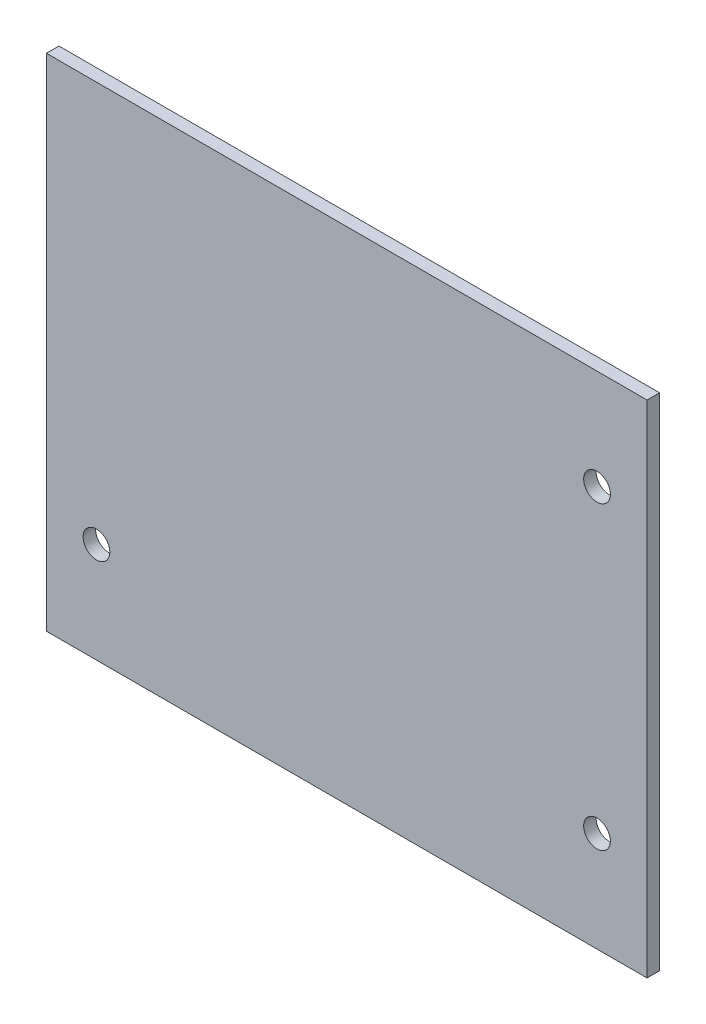
ISO-10303-21;
HEADER;
FILE_DESCRIPTION(('STEP AP214'),'2;1');
FILE_NAME('part.step','',(''),(''),'','','');
FILE_SCHEMA(('AUTOMOTIVE_DESIGN { 1 0 10303 214 1 1 1 1 }'));
ENDSEC;
DATA;
#1=APPLICATION_CONTEXT('core data for automotive mechanical design processes');
#2=APPLICATION_PROTOCOL_DEFINITION('international standard','automotive_design',2000,#1);
#3=PRODUCT_CONTEXT('',#1,'mechanical');
#4=PRODUCT('Part','Part','',(#3));
#5=PRODUCT_RELATED_PRODUCT_CATEGORY('part','',(#4));
#6=PRODUCT_DEFINITION_FORMATION('','',#4);
#7=PRODUCT_DEFINITION_CONTEXT('part definition',#1,'design');
#8=PRODUCT_DEFINITION('design','',#6,#7);
#9=PRODUCT_DEFINITION_SHAPE('','',#8);
#10=(LENGTH_UNIT() NAMED_UNIT(*) SI_UNIT(.MILLI.,.METRE.));
#11=(NAMED_UNIT(*) PLANE_ANGLE_UNIT() SI_UNIT($,.RADIAN.));
#12=(NAMED_UNIT(*) SI_UNIT($,.STERADIAN.) SOLID_ANGLE_UNIT());
#13=UNCERTAINTY_MEASURE_WITH_UNIT(LENGTH_MEASURE(1.E-05),#10,'distance_accuracy_value','');
#14=(GEOMETRIC_REPRESENTATION_CONTEXT(3) GLOBAL_UNCERTAINTY_ASSIGNED_CONTEXT((#13)) GLOBAL_UNIT_ASSIGNED_CONTEXT((#10,
#11,#12)) REPRESENTATION_CONTEXT('',''));
#15=CARTESIAN_POINT('',(0.,0.,0.));
#16=DIRECTION('',(0.,0.,1.));
#17=DIRECTION('',(1.,0.,0.));
#18=AXIS2_PLACEMENT_3D('',#15,#16,#17);
#19=CARTESIAN_POINT('',(0.,0.,3.175));
#20=DIRECTION('',(0.,0.,-1.));
#21=DIRECTION('',(-1.,0.,0.));
#22=AXIS2_PLACEMENT_3D('',#19,#20,#21);
#23=PLANE('',#22);
#24=DIRECTION('',(0.,1.,0.));
#25=VECTOR('',#24,1.);
#26=CARTESIAN_POINT('',(76.2,-63.5,3.175));
#27=LINE('',#26,#25);
#28=CARTESIAN_POINT('',(76.2,-63.5,3.175));
#29=VERTEX_POINT('',#28);
#30=CARTESIAN_POINT('',(76.2,63.5,3.175));
#31=VERTEX_POINT('',#30);
#32=EDGE_CURVE('E96',#29,#31,#27,.T.);
#33=ORIENTED_EDGE('',*,*,#32,.T.);
#34=DIRECTION('',(-1.,0.,0.));
#35=VECTOR('',#34,1.);
#36=CARTESIAN_POINT('',(-76.2,63.5,3.175));
#37=LINE('',#36,#35);
#38=CARTESIAN_POINT('',(-76.2,63.5,3.175));
#39=VERTEX_POINT('',#38);
#40=EDGE_CURVE('E91',#31,#39,#37,.T.);
#41=ORIENTED_EDGE('',*,*,#40,.T.);
#42=DIRECTION('',(0.,-1.,0.));
#43=VECTOR('',#42,1.);
#44=CARTESIAN_POINT('',(-76.2,-63.5,3.175));
#45=LINE('',#44,#43);
#46=CARTESIAN_POINT('',(-76.2,-63.5,3.175));
#47=VERTEX_POINT('',#46);
#48=EDGE_CURVE('E94',#39,#47,#45,.T.);
#49=ORIENTED_EDGE('',*,*,#48,.T.);
#50=DIRECTION('',(1.,0.,0.));
#51=VECTOR('',#50,1.);
#52=CARTESIAN_POINT('',(-76.2,-63.5,3.175));
#53=LINE('',#52,#51);
#54=EDGE_CURVE('E61',#47,#29,#53,.T.);
#55=ORIENTED_EDGE('',*,*,#54,.T.);
#56=EDGE_LOOP('',(#33,#41,#49,#55));
#57=FACE_BOUND('',#56,.T.);
#58=CARTESIAN_POINT('',(63.5,38.1,3.175));
#59=DIRECTION('',(0.,0.,1.));
#60=DIRECTION('',(1.,0.,0.));
#61=AXIS2_PLACEMENT_3D('',#58,#59,#60);
#62=CIRCLE('',#61,3.39090000000001);
#63=CARTESIAN_POINT('',(66.8909,38.1,3.175));
#64=VERTEX_POINT('',#63);
#65=EDGE_CURVE('E116',#64,#64,#62,.T.);
#66=ORIENTED_EDGE('',*,*,#65,.F.);
#67=EDGE_LOOP('',(#66));
#68=FACE_BOUND('',#67,.T.);
#69=CARTESIAN_POINT('',(63.5,-38.1,3.175));
#70=DIRECTION('',(0.,0.,1.));
#71=DIRECTION('',(1.,0.,0.));
#72=AXIS2_PLACEMENT_3D('',#69,#70,#71);
#73=CIRCLE('',#72,3.39090000000001);
#74=CARTESIAN_POINT('',(66.8909,-38.1,3.175));
#75=VERTEX_POINT('',#74);
#76=EDGE_CURVE('E138',#75,#75,#73,.T.);
#77=ORIENTED_EDGE('',*,*,#76,.F.);
#78=EDGE_LOOP('',(#77));
#79=FACE_BOUND('',#78,.T.);
#80=CARTESIAN_POINT('',(-63.5,-38.1,3.175));
#81=DIRECTION('',(0.,0.,1.));
#82=DIRECTION('',(1.,0.,0.));
#83=AXIS2_PLACEMENT_3D('',#80,#81,#82);
#84=CIRCLE('',#83,3.3909);
#85=CARTESIAN_POINT('',(-60.1091,-38.1,3.175));
#86=VERTEX_POINT('',#85);
#87=EDGE_CURVE('E146',#86,#86,#84,.T.);
#88=ORIENTED_EDGE('',*,*,#87,.F.);
#89=EDGE_LOOP('',(#88));
#90=FACE_BOUND('',#89,.T.);
#91=ADVANCED_FACE('F43',(#57,#68,#79,#90),#23,.F.);
#92=CARTESIAN_POINT('',(0.,0.,0.));
#93=DIRECTION('',(0.,0.,-1.));
#94=DIRECTION('',(-1.,0.,0.));
#95=AXIS2_PLACEMENT_3D('',#92,#93,#94);
#96=PLANE('',#95);
#97=CARTESIAN_POINT('',(63.5,-38.1,0.));
#98=DIRECTION('',(0.,0.,1.));
#99=DIRECTION('',(1.,0.,0.));
#100=AXIS2_PLACEMENT_3D('',#97,#98,#99);
#101=CIRCLE('',#100,3.39090000000001);
#102=CARTESIAN_POINT('',(66.8909,-38.1,0.));
#103=VERTEX_POINT('',#102);
#104=EDGE_CURVE('E142',#103,#103,#101,.T.);
#105=ORIENTED_EDGE('',*,*,#104,.T.);
#106=EDGE_LOOP('',(#105));
#107=FACE_BOUND('',#106,.T.);
#108=DIRECTION('',(0.,1.,0.));
#109=VECTOR('',#108,1.);
#110=CARTESIAN_POINT('',(76.2,-63.5,0.));
#111=LINE('',#110,#109);
#112=CARTESIAN_POINT('',(76.2,-63.5,0.));
#113=VERTEX_POINT('',#112);
#114=CARTESIAN_POINT('',(76.2,63.5,0.));
#115=VERTEX_POINT('',#114);
#116=EDGE_CURVE('E112',#113,#115,#111,.T.);
#117=ORIENTED_EDGE('',*,*,#116,.F.);
#118=DIRECTION('',(1.,0.,0.));
#119=VECTOR('',#118,1.);
#120=CARTESIAN_POINT('',(-76.2,-63.5,0.));
#121=LINE('',#120,#119);
#122=CARTESIAN_POINT('',(-76.2,-63.5,0.));
#123=VERTEX_POINT('',#122);
#124=EDGE_CURVE('E84',#123,#113,#121,.T.);
#125=ORIENTED_EDGE('',*,*,#124,.F.);
#126=DIRECTION('',(0.,-1.,0.));
#127=VECTOR('',#126,1.);
#128=CARTESIAN_POINT('',(-76.2,-63.5,0.));
#129=LINE('',#128,#127);
#130=CARTESIAN_POINT('',(-76.2,63.5,0.));
#131=VERTEX_POINT('',#130);
#132=EDGE_CURVE('E78',#131,#123,#129,.T.);
#133=ORIENTED_EDGE('',*,*,#132,.F.);
#134=DIRECTION('',(-1.,0.,0.));
#135=VECTOR('',#134,1.);
#136=CARTESIAN_POINT('',(-76.2,63.5,0.));
#137=LINE('',#136,#135);
#138=EDGE_CURVE('E101',#115,#131,#137,.T.);
#139=ORIENTED_EDGE('',*,*,#138,.F.);
#140=EDGE_LOOP('',(#117,#125,#133,#139));
#141=FACE_BOUND('',#140,.T.);
#142=CARTESIAN_POINT('',(63.5,38.1,0.));
#143=DIRECTION('',(0.,0.,1.));
#144=DIRECTION('',(1.,0.,0.));
#145=AXIS2_PLACEMENT_3D('',#142,#143,#144);
#146=CIRCLE('',#145,3.39090000000001);
#147=CARTESIAN_POINT('',(66.8909,38.1,0.));
#148=VERTEX_POINT('',#147);
#149=EDGE_CURVE('E134',#148,#148,#146,.T.);
#150=ORIENTED_EDGE('',*,*,#149,.T.);
#151=EDGE_LOOP('',(#150));
#152=FACE_BOUND('',#151,.T.);
#153=CARTESIAN_POINT('',(-63.5,-38.1,0.));
#154=DIRECTION('',(0.,0.,1.));
#155=DIRECTION('',(1.,0.,0.));
#156=AXIS2_PLACEMENT_3D('',#153,#154,#155);
#157=CIRCLE('',#156,3.3909);
#158=CARTESIAN_POINT('',(-60.1091,-38.1,0.));
#159=VERTEX_POINT('',#158);
#160=EDGE_CURVE('E150',#159,#159,#157,.T.);
#161=ORIENTED_EDGE('',*,*,#160,.T.);
#162=EDGE_LOOP('',(#161));
#163=FACE_BOUND('',#162,.T.);
#164=ADVANCED_FACE('F129',(#107,#141,#152,#163),#96,.T.);
#165=CARTESIAN_POINT('',(76.2,-63.5,3.175));
#166=DIRECTION('',(-1.,0.,0.));
#167=DIRECTION('',(0.,0.,1.));
#168=AXIS2_PLACEMENT_3D('',#165,#166,#167);
#169=PLANE('',#168);
#170=ORIENTED_EDGE('',*,*,#116,.T.);
#171=DIRECTION('',(0.,0.,-1.));
#172=VECTOR('',#171,1.);
#173=CARTESIAN_POINT('',(76.2,63.5,3.175));
#174=LINE('',#173,#172);
#175=EDGE_CURVE('E11',#31,#115,#174,.T.);
#176=ORIENTED_EDGE('',*,*,#175,.F.);
#177=ORIENTED_EDGE('',*,*,#32,.F.);
#178=DIRECTION('',(0.,0.,-1.));
#179=VECTOR('',#178,1.);
#180=CARTESIAN_POINT('',(76.2,-63.5,3.175));
#181=LINE('',#180,#179);
#182=EDGE_CURVE('E108',#29,#113,#181,.T.);
#183=ORIENTED_EDGE('',*,*,#182,.T.);
#184=EDGE_LOOP('',(#170,#176,#177,#183));
#185=FACE_BOUND('',#184,.T.);
#186=ADVANCED_FACE('F45',(#185),#169,.F.);
#187=CARTESIAN_POINT('',(-76.2,63.5,3.175));
#188=DIRECTION('',(0.,-1.,0.));
#189=DIRECTION('',(0.,0.,-1.));
#190=AXIS2_PLACEMENT_3D('',#187,#188,#189);
#191=PLANE('',#190);
#192=ORIENTED_EDGE('',*,*,#138,.T.);
#193=DIRECTION('',(0.,0.,-1.));
#194=VECTOR('',#193,1.);
#195=CARTESIAN_POINT('',(-76.2,63.5,3.175));
#196=LINE('',#195,#194);
#197=EDGE_CURVE('E53',#39,#131,#196,.T.);
#198=ORIENTED_EDGE('',*,*,#197,.F.);
#199=ORIENTED_EDGE('',*,*,#40,.F.);
#200=ORIENTED_EDGE('',*,*,#175,.T.);
#201=EDGE_LOOP('',(#192,#198,#199,#200));
#202=FACE_BOUND('',#201,.T.);
#203=ADVANCED_FACE('F100',(#202),#191,.F.);
#204=CARTESIAN_POINT('',(-76.2,-63.5,3.175));
#205=DIRECTION('',(1.,0.,0.));
#206=DIRECTION('',(0.,0.,-1.));
#207=AXIS2_PLACEMENT_3D('',#204,#205,#206);
#208=PLANE('',#207);
#209=ORIENTED_EDGE('',*,*,#132,.T.);
#210=DIRECTION('',(0.,0.,-1.));
#211=VECTOR('',#210,1.);
#212=CARTESIAN_POINT('',(-76.2,-63.5,3.175));
#213=LINE('',#212,#211);
#214=EDGE_CURVE('E103',#47,#123,#213,.T.);
#215=ORIENTED_EDGE('',*,*,#214,.F.);
#216=ORIENTED_EDGE('',*,*,#48,.F.);
#217=ORIENTED_EDGE('',*,*,#197,.T.);
#218=EDGE_LOOP('',(#209,#215,#216,#217));
#219=FACE_BOUND('',#218,.T.);
#220=ADVANCED_FACE('F104',(#219),#208,.F.);
#221=CARTESIAN_POINT('',(-76.2,-63.5,3.175));
#222=DIRECTION('',(0.,1.,0.));
#223=DIRECTION('',(0.,0.,1.));
#224=AXIS2_PLACEMENT_3D('',#221,#222,#223);
#225=PLANE('',#224);
#226=ORIENTED_EDGE('',*,*,#124,.T.);
#227=ORIENTED_EDGE('',*,*,#182,.F.);
#228=ORIENTED_EDGE('',*,*,#54,.F.);
#229=ORIENTED_EDGE('',*,*,#214,.T.);
#230=EDGE_LOOP('',(#226,#227,#228,#229));
#231=FACE_BOUND('',#230,.T.);
#232=ADVANCED_FACE('F126',(#231),#225,.F.);
#233=CARTESIAN_POINT('',(63.5,38.1,3.175));
#234=DIRECTION('',(0.,0.,-1.));
#235=DIRECTION('',(-1.,0.,0.));
#236=AXIS2_PLACEMENT_3D('',#233,#234,#235);
#237=CYLINDRICAL_SURFACE('',#236,3.39090000000001);
#238=ORIENTED_EDGE('',*,*,#65,.T.);
#239=EDGE_LOOP('',(#238));
#240=FACE_BOUND('',#239,.T.);
#241=ORIENTED_EDGE('',*,*,#149,.F.);
#242=EDGE_LOOP('',(#241));
#243=FACE_BOUND('',#242,.T.);
#244=ADVANCED_FACE('F169',(#240,#243),#237,.F.);
#245=CARTESIAN_POINT('',(63.5,-38.1,3.175));
#246=DIRECTION('',(0.,0.,-1.));
#247=DIRECTION('',(-1.,0.,0.));
#248=AXIS2_PLACEMENT_3D('',#245,#246,#247);
#249=CYLINDRICAL_SURFACE('',#248,3.39090000000001);
#250=ORIENTED_EDGE('',*,*,#76,.T.);
#251=EDGE_LOOP('',(#250));
#252=FACE_BOUND('',#251,.T.);
#253=ORIENTED_EDGE('',*,*,#104,.F.);
#254=EDGE_LOOP('',(#253));
#255=FACE_BOUND('',#254,.T.);
#256=ADVANCED_FACE('F223',(#252,#255),#249,.F.);
#257=CARTESIAN_POINT('',(-63.5,-38.1,3.175));
#258=DIRECTION('',(0.,0.,-1.));
#259=DIRECTION('',(-1.,0.,0.));
#260=AXIS2_PLACEMENT_3D('',#257,#258,#259);
#261=CYLINDRICAL_SURFACE('',#260,3.3909);
#262=ORIENTED_EDGE('',*,*,#87,.T.);
#263=EDGE_LOOP('',(#262));
#264=FACE_BOUND('',#263,.T.);
#265=ORIENTED_EDGE('',*,*,#160,.F.);
#266=EDGE_LOOP('',(#265));
#267=FACE_BOUND('',#266,.T.);
#268=ADVANCED_FACE('F158',(#264,#267),#261,.F.);
#269=CLOSED_SHELL('',(#91,#164,#186,#203,#220,#232,#244,#256,#268));
#270=MANIFOLD_SOLID_BREP('B2',#269);
#271=ADVANCED_BREP_SHAPE_REPRESENTATION('',(#18,#270),#14);
#272=SHAPE_DEFINITION_REPRESENTATION(#9,#271);
ENDSEC;
END-ISO-10303-21;
